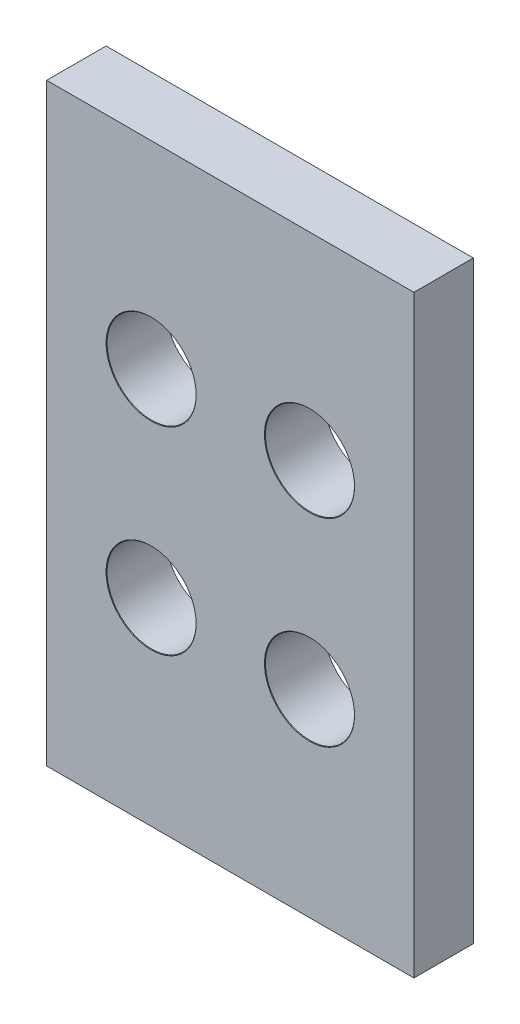
ISO-10303-21;
HEADER;
FILE_DESCRIPTION(('STEP AP214'),'2;1');
FILE_NAME('part.step','',(''),(''),'','','');
FILE_SCHEMA(('AUTOMOTIVE_DESIGN { 1 0 10303 214 1 1 1 1 }'));
ENDSEC;
DATA;
#1=APPLICATION_CONTEXT('core data for automotive mechanical design processes');
#2=APPLICATION_PROTOCOL_DEFINITION('international standard','automotive_design',2000,#1);
#3=PRODUCT_CONTEXT('',#1,'mechanical');
#4=PRODUCT('Part','Part','',(#3));
#5=PRODUCT_RELATED_PRODUCT_CATEGORY('part','',(#4));
#6=PRODUCT_DEFINITION_FORMATION('','',#4);
#7=PRODUCT_DEFINITION_CONTEXT('part definition',#1,'design');
#8=PRODUCT_DEFINITION('design','',#6,#7);
#9=PRODUCT_DEFINITION_SHAPE('','',#8);
#10=(LENGTH_UNIT() NAMED_UNIT(*) SI_UNIT(.MILLI.,.METRE.));
#11=(NAMED_UNIT(*) PLANE_ANGLE_UNIT() SI_UNIT($,.RADIAN.));
#12=(NAMED_UNIT(*) SI_UNIT($,.STERADIAN.) SOLID_ANGLE_UNIT());
#13=UNCERTAINTY_MEASURE_WITH_UNIT(LENGTH_MEASURE(1.E-05),#10,'distance_accuracy_value','');
#14=(GEOMETRIC_REPRESENTATION_CONTEXT(3) GLOBAL_UNCERTAINTY_ASSIGNED_CONTEXT((#13)) GLOBAL_UNIT_ASSIGNED_CONTEXT((#10,
#11,#12)) REPRESENTATION_CONTEXT('',''));
#15=CARTESIAN_POINT('',(0.,0.,0.));
#16=DIRECTION('',(0.,0.,1.));
#17=DIRECTION('',(1.,0.,0.));
#18=AXIS2_PLACEMENT_3D('',#15,#16,#17);
#19=CARTESIAN_POINT('',(9.275,-15.,1.5));
#20=DIRECTION('',(-1.,0.,0.));
#21=DIRECTION('',(0.,0.,1.));
#22=AXIS2_PLACEMENT_3D('',#19,#20,#21);
#23=PLANE('',#22);
#24=DIRECTION('',(0.,1.,0.));
#25=VECTOR('',#24,1.);
#26=CARTESIAN_POINT('',(9.275,-15.,-1.5));
#27=LINE('',#26,#25);
#28=CARTESIAN_POINT('',(9.275,-15.,-1.5));
#29=VERTEX_POINT('',#28);
#30=CARTESIAN_POINT('',(9.275,15.,-1.5));
#31=VERTEX_POINT('',#30);
#32=EDGE_CURVE('E106',#29,#31,#27,.T.);
#33=ORIENTED_EDGE('',*,*,#32,.T.);
#34=DIRECTION('',(0.,0.,-1.));
#35=VECTOR('',#34,1.);
#36=CARTESIAN_POINT('',(9.275,15.,1.5));
#37=LINE('',#36,#35);
#38=CARTESIAN_POINT('',(9.275,15.,1.5));
#39=VERTEX_POINT('',#38);
#40=EDGE_CURVE('E11',#39,#31,#37,.T.);
#41=ORIENTED_EDGE('',*,*,#40,.F.);
#42=DIRECTION('',(0.,1.,0.));
#43=VECTOR('',#42,1.);
#44=CARTESIAN_POINT('',(9.275,-15.,1.5));
#45=LINE('',#44,#43);
#46=CARTESIAN_POINT('',(9.275,-15.,1.5));
#47=VERTEX_POINT('',#46);
#48=EDGE_CURVE('E94',#47,#39,#45,.T.);
#49=ORIENTED_EDGE('',*,*,#48,.F.);
#50=DIRECTION('',(0.,0.,-1.));
#51=VECTOR('',#50,1.);
#52=CARTESIAN_POINT('',(9.275,-15.,1.5));
#53=LINE('',#52,#51);
#54=EDGE_CURVE('E102',#47,#29,#53,.T.);
#55=ORIENTED_EDGE('',*,*,#54,.T.);
#56=EDGE_LOOP('',(#33,#41,#49,#55));
#57=FACE_BOUND('',#56,.T.);
#58=ADVANCED_FACE('F43',(#57),#23,.F.);
#59=CARTESIAN_POINT('',(9.275,15.,1.5));
#60=DIRECTION('',(0.,-1.,0.));
#61=DIRECTION('',(1.,0.,0.));
#62=AXIS2_PLACEMENT_3D('',#59,#60,#61);
#63=PLANE('',#62);
#64=DIRECTION('',(-1.,0.,0.));
#65=VECTOR('',#64,1.);
#66=CARTESIAN_POINT('',(9.275,15.,-1.5));
#67=LINE('',#66,#65);
#68=CARTESIAN_POINT('',(-9.275,15.,-1.5));
#69=VERTEX_POINT('',#68);
#70=EDGE_CURVE('E98',#31,#69,#67,.T.);
#71=ORIENTED_EDGE('',*,*,#70,.T.);
#72=DIRECTION('',(0.,0.,-1.));
#73=VECTOR('',#72,1.);
#74=CARTESIAN_POINT('',(-9.275,15.,1.5));
#75=LINE('',#74,#73);
#76=CARTESIAN_POINT('',(-9.275,15.,1.5));
#77=VERTEX_POINT('',#76);
#78=EDGE_CURVE('E51',#77,#69,#75,.T.);
#79=ORIENTED_EDGE('',*,*,#78,.F.);
#80=DIRECTION('',(-1.,0.,0.));
#81=VECTOR('',#80,1.);
#82=CARTESIAN_POINT('',(9.275,15.,1.5));
#83=LINE('',#82,#81);
#84=EDGE_CURVE('E89',#39,#77,#83,.T.);
#85=ORIENTED_EDGE('',*,*,#84,.F.);
#86=ORIENTED_EDGE('',*,*,#40,.T.);
#87=EDGE_LOOP('',(#71,#79,#85,#86));
#88=FACE_BOUND('',#87,.T.);
#89=ADVANCED_FACE('F97',(#88),#63,.F.);
#90=CARTESIAN_POINT('',(-9.275,-15.,1.5));
#91=DIRECTION('',(1.,0.,0.));
#92=DIRECTION('',(0.,0.,-1.));
#93=AXIS2_PLACEMENT_3D('',#90,#91,#92);
#94=PLANE('',#93);
#95=DIRECTION('',(0.,-1.,0.));
#96=VECTOR('',#95,1.);
#97=CARTESIAN_POINT('',(-9.275,-15.,-1.5));
#98=LINE('',#97,#96);
#99=CARTESIAN_POINT('',(-9.275,-15.,-1.5));
#100=VERTEX_POINT('',#99);
#101=EDGE_CURVE('E76',#69,#100,#98,.T.);
#102=ORIENTED_EDGE('',*,*,#101,.T.);
#103=DIRECTION('',(0.,0.,-1.));
#104=VECTOR('',#103,1.);
#105=CARTESIAN_POINT('',(-9.275,-15.,1.5));
#106=LINE('',#105,#104);
#107=CARTESIAN_POINT('',(-9.275,-15.,1.5));
#108=VERTEX_POINT('',#107);
#109=EDGE_CURVE('E99',#108,#100,#106,.T.);
#110=ORIENTED_EDGE('',*,*,#109,.F.);
#111=DIRECTION('',(0.,-1.,0.));
#112=VECTOR('',#111,1.);
#113=CARTESIAN_POINT('',(-9.275,-15.,1.5));
#114=LINE('',#113,#112);
#115=EDGE_CURVE('E92',#77,#108,#114,.T.);
#116=ORIENTED_EDGE('',*,*,#115,.F.);
#117=ORIENTED_EDGE('',*,*,#78,.T.);
#118=EDGE_LOOP('',(#102,#110,#116,#117));
#119=FACE_BOUND('',#118,.T.);
#120=ADVANCED_FACE('F100',(#119),#94,.F.);
#121=CARTESIAN_POINT('',(9.275,-15.,1.5));
#122=DIRECTION('',(0.,1.,0.));
#123=DIRECTION('',(-1.,0.,0.));
#124=AXIS2_PLACEMENT_3D('',#121,#122,#123);
#125=PLANE('',#124);
#126=DIRECTION('',(1.,0.,0.));
#127=VECTOR('',#126,1.);
#128=CARTESIAN_POINT('',(9.275,-15.,-1.5));
#129=LINE('',#128,#127);
#130=EDGE_CURVE('E82',#100,#29,#129,.T.);
#131=ORIENTED_EDGE('',*,*,#130,.T.);
#132=ORIENTED_EDGE('',*,*,#54,.F.);
#133=DIRECTION('',(1.,0.,0.));
#134=VECTOR('',#133,1.);
#135=CARTESIAN_POINT('',(9.275,-15.,1.5));
#136=LINE('',#135,#134);
#137=EDGE_CURVE('E59',#108,#47,#136,.T.);
#138=ORIENTED_EDGE('',*,*,#137,.F.);
#139=ORIENTED_EDGE('',*,*,#109,.T.);
#140=EDGE_LOOP('',(#131,#132,#138,#139));
#141=FACE_BOUND('',#140,.T.);
#142=ADVANCED_FACE('F114',(#141),#125,.F.);
#143=CARTESIAN_POINT('',(0.,0.,1.5));
#144=DIRECTION('',(0.,0.,1.));
#145=DIRECTION('',(1.,0.,0.));
#146=AXIS2_PLACEMENT_3D('',#143,#144,#145);
#147=PLANE('',#146);
#148=CARTESIAN_POINT('',(4.,5.005,1.5));
#149=DIRECTION('',(0.,0.,1.));
#150=DIRECTION('',(1.,0.,0.));
#151=AXIS2_PLACEMENT_3D('',#148,#149,#150);
#152=CIRCLE('',#151,2.275);
#153=CARTESIAN_POINT('',(6.275,5.005,1.5));
#154=VERTEX_POINT('',#153);
#155=EDGE_CURVE('E152',#154,#154,#152,.T.);
#156=ORIENTED_EDGE('',*,*,#155,.F.);
#157=EDGE_LOOP('',(#156));
#158=FACE_BOUND('',#157,.T.);
#159=CARTESIAN_POINT('',(-4.,5.005,1.5));
#160=DIRECTION('',(0.,0.,1.));
#161=DIRECTION('',(1.,0.,0.));
#162=AXIS2_PLACEMENT_3D('',#159,#160,#161);
#163=CIRCLE('',#162,2.275);
#164=CARTESIAN_POINT('',(-1.725,5.005,1.5));
#165=VERTEX_POINT('',#164);
#166=EDGE_CURVE('E143',#165,#165,#163,.T.);
#167=ORIENTED_EDGE('',*,*,#166,.F.);
#168=EDGE_LOOP('',(#167));
#169=FACE_BOUND('',#168,.T.);
#170=CARTESIAN_POINT('',(4.,-5.005,1.5));
#171=DIRECTION('',(0.,0.,1.));
#172=DIRECTION('',(1.,0.,0.));
#173=AXIS2_PLACEMENT_3D('',#170,#171,#172);
#174=CIRCLE('',#173,2.275);
#175=CARTESIAN_POINT('',(6.275,-5.005,1.5));
#176=VERTEX_POINT('',#175);
#177=EDGE_CURVE('E134',#176,#176,#174,.T.);
#178=ORIENTED_EDGE('',*,*,#177,.F.);
#179=EDGE_LOOP('',(#178));
#180=FACE_BOUND('',#179,.T.);
#181=CARTESIAN_POINT('',(-4.,-5.005,1.5));
#182=DIRECTION('',(0.,0.,1.));
#183=DIRECTION('',(1.,0.,0.));
#184=AXIS2_PLACEMENT_3D('',#181,#182,#183);
#185=CIRCLE('',#184,2.275);
#186=CARTESIAN_POINT('',(-1.725,-5.005,1.5));
#187=VERTEX_POINT('',#186);
#188=EDGE_CURVE('E125',#187,#187,#185,.T.);
#189=ORIENTED_EDGE('',*,*,#188,.F.);
#190=EDGE_LOOP('',(#189));
#191=FACE_BOUND('',#190,.T.);
#192=ORIENTED_EDGE('',*,*,#48,.T.);
#193=ORIENTED_EDGE('',*,*,#84,.T.);
#194=ORIENTED_EDGE('',*,*,#115,.T.);
#195=ORIENTED_EDGE('',*,*,#137,.T.);
#196=EDGE_LOOP('',(#192,#193,#194,#195));
#197=FACE_BOUND('',#196,.T.);
#198=ADVANCED_FACE('F90',(#158,#169,#180,#191,#197),#147,.T.);
#199=CARTESIAN_POINT('',(0.,0.,-1.5));
#200=DIRECTION('',(0.,0.,1.));
#201=DIRECTION('',(1.,0.,0.));
#202=AXIS2_PLACEMENT_3D('',#199,#200,#201);
#203=PLANE('',#202);
#204=CARTESIAN_POINT('',(4.,5.005,-1.5));
#205=DIRECTION('',(0.,0.,1.));
#206=DIRECTION('',(1.,0.,0.));
#207=AXIS2_PLACEMENT_3D('',#204,#205,#206);
#208=CIRCLE('',#207,2.24999999999999);
#209=CARTESIAN_POINT('',(6.25,5.005,-1.5));
#210=VERTEX_POINT('',#209);
#211=EDGE_CURVE('E146',#210,#210,#208,.T.);
#212=ORIENTED_EDGE('',*,*,#211,.T.);
#213=EDGE_LOOP('',(#212));
#214=FACE_BOUND('',#213,.T.);
#215=CARTESIAN_POINT('',(-4.,5.005,-1.5));
#216=DIRECTION('',(0.,0.,1.));
#217=DIRECTION('',(1.,0.,0.));
#218=AXIS2_PLACEMENT_3D('',#215,#216,#217);
#219=CIRCLE('',#218,2.24999999999999);
#220=CARTESIAN_POINT('',(-1.75,5.005,-1.5));
#221=VERTEX_POINT('',#220);
#222=EDGE_CURVE('E137',#221,#221,#219,.T.);
#223=ORIENTED_EDGE('',*,*,#222,.T.);
#224=EDGE_LOOP('',(#223));
#225=FACE_BOUND('',#224,.T.);
#226=CARTESIAN_POINT('',(4.,-5.005,-1.5));
#227=DIRECTION('',(0.,0.,1.));
#228=DIRECTION('',(1.,0.,0.));
#229=AXIS2_PLACEMENT_3D('',#226,#227,#228);
#230=CIRCLE('',#229,2.24999999999999);
#231=CARTESIAN_POINT('',(6.25,-5.005,-1.5));
#232=VERTEX_POINT('',#231);
#233=EDGE_CURVE('E128',#232,#232,#230,.T.);
#234=ORIENTED_EDGE('',*,*,#233,.T.);
#235=EDGE_LOOP('',(#234));
#236=FACE_BOUND('',#235,.T.);
#237=CARTESIAN_POINT('',(-4.,-5.005,-1.5));
#238=DIRECTION('',(0.,0.,1.));
#239=DIRECTION('',(1.,0.,0.));
#240=AXIS2_PLACEMENT_3D('',#237,#238,#239);
#241=CIRCLE('',#240,2.24999999999999);
#242=CARTESIAN_POINT('',(-1.75,-5.005,-1.5));
#243=VERTEX_POINT('',#242);
#244=EDGE_CURVE('E109',#243,#243,#241,.T.);
#245=ORIENTED_EDGE('',*,*,#244,.T.);
#246=EDGE_LOOP('',(#245));
#247=FACE_BOUND('',#246,.T.);
#248=ORIENTED_EDGE('',*,*,#32,.F.);
#249=ORIENTED_EDGE('',*,*,#130,.F.);
#250=ORIENTED_EDGE('',*,*,#101,.F.);
#251=ORIENTED_EDGE('',*,*,#70,.F.);
#252=EDGE_LOOP('',(#248,#249,#250,#251));
#253=FACE_BOUND('',#252,.T.);
#254=ADVANCED_FACE('F117',(#214,#225,#236,#247,#253),#203,.F.);
#255=CARTESIAN_POINT('',(-4.,-5.005,1.5));
#256=DIRECTION('',(0.,0.,1.));
#257=DIRECTION('',(1.,0.,0.));
#258=AXIS2_PLACEMENT_3D('',#255,#256,#257);
#259=CYLINDRICAL_SURFACE('',#258,2.24999999999999);
#260=ORIENTED_EDGE('',*,*,#244,.F.);
#261=EDGE_LOOP('',(#260));
#262=FACE_BOUND('',#261,.T.);
#263=CARTESIAN_POINT('',(-4.,-5.005,1.47585778062983));
#264=DIRECTION('',(0.,0.,1.));
#265=DIRECTION('',(1.,0.,0.));
#266=AXIS2_PLACEMENT_3D('',#263,#264,#265);
#267=CIRCLE('',#266,2.24999999999999);
#268=CARTESIAN_POINT('',(-1.75000000000001,-5.005,1.47585778062983));
#269=VERTEX_POINT('',#268);
#270=EDGE_CURVE('E122',#269,#269,#267,.T.);
#271=ORIENTED_EDGE('',*,*,#270,.T.);
#272=EDGE_LOOP('',(#271));
#273=FACE_BOUND('',#272,.T.);
#274=ADVANCED_FACE('F170',(#262,#273),#259,.F.);
#275=CARTESIAN_POINT('',(-4.,-5.005,1.5));
#276=DIRECTION('',(0.,0.,1.));
#277=DIRECTION('',(1.,0.,0.));
#278=AXIS2_PLACEMENT_3D('',#275,#276,#277);
#279=CONICAL_SURFACE('',#278,2.275,0.802851455917809);
#280=ORIENTED_EDGE('',*,*,#270,.F.);
#281=EDGE_LOOP('',(#280));
#282=FACE_BOUND('',#281,.T.);
#283=ORIENTED_EDGE('',*,*,#188,.T.);
#284=EDGE_LOOP('',(#283));
#285=FACE_BOUND('',#284,.T.);
#286=ADVANCED_FACE('F167',(#282,#285),#279,.F.);
#287=CARTESIAN_POINT('',(4.,-5.005,1.5));
#288=DIRECTION('',(0.,0.,1.));
#289=DIRECTION('',(1.,0.,0.));
#290=AXIS2_PLACEMENT_3D('',#287,#288,#289);
#291=CYLINDRICAL_SURFACE('',#290,2.24999999999999);
#292=ORIENTED_EDGE('',*,*,#233,.F.);
#293=EDGE_LOOP('',(#292));
#294=FACE_BOUND('',#293,.T.);
#295=CARTESIAN_POINT('',(4.,-5.005,1.47585778062983));
#296=DIRECTION('',(0.,0.,1.));
#297=DIRECTION('',(1.,0.,0.));
#298=AXIS2_PLACEMENT_3D('',#295,#296,#297);
#299=CIRCLE('',#298,2.24999999999999);
#300=CARTESIAN_POINT('',(6.24999999999999,-5.005,1.47585778062983));
#301=VERTEX_POINT('',#300);
#302=EDGE_CURVE('E131',#301,#301,#299,.T.);
#303=ORIENTED_EDGE('',*,*,#302,.T.);
#304=EDGE_LOOP('',(#303));
#305=FACE_BOUND('',#304,.T.);
#306=ADVANCED_FACE('F169',(#294,#305),#291,.F.);
#307=CARTESIAN_POINT('',(4.,-5.005,1.5));
#308=DIRECTION('',(0.,0.,1.));
#309=DIRECTION('',(1.,0.,0.));
#310=AXIS2_PLACEMENT_3D('',#307,#308,#309);
#311=CONICAL_SURFACE('',#310,2.275,0.802851455917809);
#312=ORIENTED_EDGE('',*,*,#302,.F.);
#313=EDGE_LOOP('',(#312));
#314=FACE_BOUND('',#313,.T.);
#315=ORIENTED_EDGE('',*,*,#177,.T.);
#316=EDGE_LOOP('',(#315));
#317=FACE_BOUND('',#316,.T.);
#318=ADVANCED_FACE('F177',(#314,#317),#311,.F.);
#319=CARTESIAN_POINT('',(-4.,5.005,1.5));
#320=DIRECTION('',(0.,0.,1.));
#321=DIRECTION('',(1.,0.,0.));
#322=AXIS2_PLACEMENT_3D('',#319,#320,#321);
#323=CYLINDRICAL_SURFACE('',#322,2.24999999999999);
#324=ORIENTED_EDGE('',*,*,#222,.F.);
#325=EDGE_LOOP('',(#324));
#326=FACE_BOUND('',#325,.T.);
#327=CARTESIAN_POINT('',(-4.,5.005,1.47585778062983));
#328=DIRECTION('',(0.,0.,1.));
#329=DIRECTION('',(1.,0.,0.));
#330=AXIS2_PLACEMENT_3D('',#327,#328,#329);
#331=CIRCLE('',#330,2.24999999999999);
#332=CARTESIAN_POINT('',(-1.75000000000001,5.005,1.47585778062983));
#333=VERTEX_POINT('',#332);
#334=EDGE_CURVE('E140',#333,#333,#331,.T.);
#335=ORIENTED_EDGE('',*,*,#334,.T.);
#336=EDGE_LOOP('',(#335));
#337=FACE_BOUND('',#336,.T.);
#338=ADVANCED_FACE('F211',(#326,#337),#323,.F.);
#339=CARTESIAN_POINT('',(-4.,5.005,1.5));
#340=DIRECTION('',(0.,0.,1.));
#341=DIRECTION('',(1.,0.,0.));
#342=AXIS2_PLACEMENT_3D('',#339,#340,#341);
#343=CONICAL_SURFACE('',#342,2.275,0.802851455917809);
#344=ORIENTED_EDGE('',*,*,#334,.F.);
#345=EDGE_LOOP('',(#344));
#346=FACE_BOUND('',#345,.T.);
#347=ORIENTED_EDGE('',*,*,#166,.T.);
#348=EDGE_LOOP('',(#347));
#349=FACE_BOUND('',#348,.T.);
#350=ADVANCED_FACE('F216',(#346,#349),#343,.F.);
#351=CARTESIAN_POINT('',(4.,5.005,1.5));
#352=DIRECTION('',(0.,0.,1.));
#353=DIRECTION('',(1.,0.,0.));
#354=AXIS2_PLACEMENT_3D('',#351,#352,#353);
#355=CYLINDRICAL_SURFACE('',#354,2.24999999999999);
#356=ORIENTED_EDGE('',*,*,#211,.F.);
#357=EDGE_LOOP('',(#356));
#358=FACE_BOUND('',#357,.T.);
#359=CARTESIAN_POINT('',(4.,5.005,1.47585778062983));
#360=DIRECTION('',(0.,0.,1.));
#361=DIRECTION('',(1.,0.,0.));
#362=AXIS2_PLACEMENT_3D('',#359,#360,#361);
#363=CIRCLE('',#362,2.24999999999999);
#364=CARTESIAN_POINT('',(6.24999999999999,5.005,1.47585778062983));
#365=VERTEX_POINT('',#364);
#366=EDGE_CURVE('E149',#365,#365,#363,.T.);
#367=ORIENTED_EDGE('',*,*,#366,.T.);
#368=EDGE_LOOP('',(#367));
#369=FACE_BOUND('',#368,.T.);
#370=ADVANCED_FACE('F222',(#358,#369),#355,.F.);
#371=CARTESIAN_POINT('',(4.,5.005,1.5));
#372=DIRECTION('',(0.,0.,1.));
#373=DIRECTION('',(1.,0.,0.));
#374=AXIS2_PLACEMENT_3D('',#371,#372,#373);
#375=CONICAL_SURFACE('',#374,2.275,0.802851455917809);
#376=ORIENTED_EDGE('',*,*,#366,.F.);
#377=EDGE_LOOP('',(#376));
#378=FACE_BOUND('',#377,.T.);
#379=ORIENTED_EDGE('',*,*,#155,.T.);
#380=EDGE_LOOP('',(#379));
#381=FACE_BOUND('',#380,.T.);
#382=ADVANCED_FACE('F156',(#378,#381),#375,.F.);
#383=CLOSED_SHELL('',(#58,#89,#120,#142,#198,#254,#274,#286,#306,#318,#338,#350,#370,#382));
#384=MANIFOLD_SOLID_BREP('B2',#383);
#385=ADVANCED_BREP_SHAPE_REPRESENTATION('',(#18,#384),#14);
#386=SHAPE_DEFINITION_REPRESENTATION(#9,#385);
ENDSEC;
END-ISO-10303-21;
